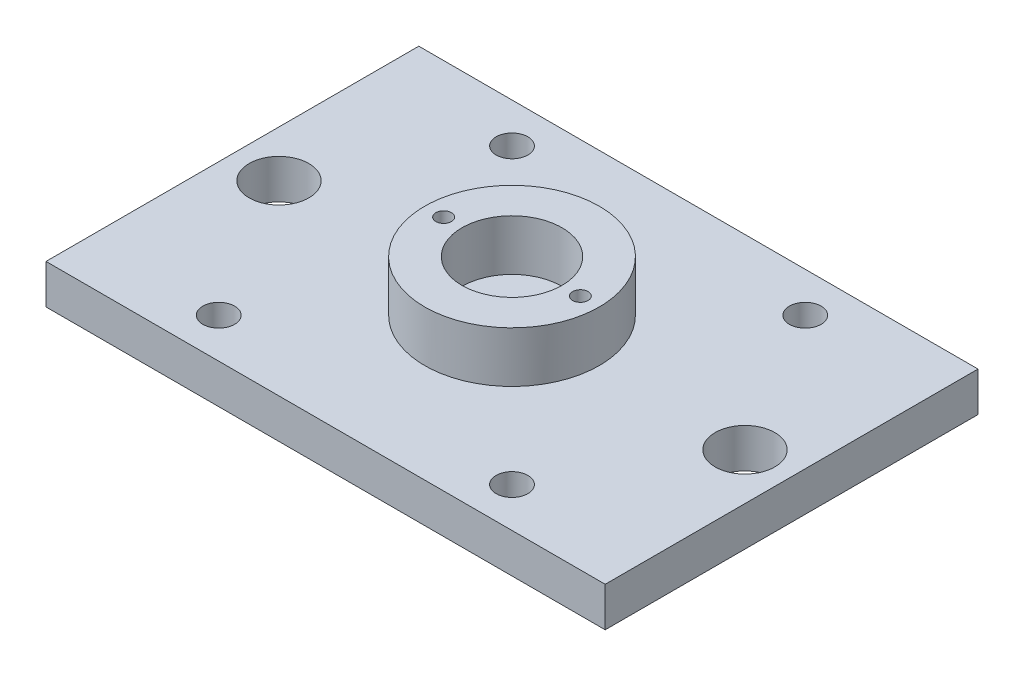
ISO-10303-21;
HEADER;
FILE_DESCRIPTION(('STEP AP214'),'2;1');
FILE_NAME('part.step','',(''),(''),'','','');
FILE_SCHEMA(('AUTOMOTIVE_DESIGN { 1 0 10303 214 1 1 1 1 }'));
ENDSEC;
DATA;
#1=APPLICATION_CONTEXT('core data for automotive mechanical design processes');
#2=APPLICATION_PROTOCOL_DEFINITION('international standard','automotive_design',2000,#1);
#3=PRODUCT_CONTEXT('',#1,'mechanical');
#4=PRODUCT('Part','Part','',(#3));
#5=PRODUCT_RELATED_PRODUCT_CATEGORY('part','',(#4));
#6=PRODUCT_DEFINITION_FORMATION('','',#4);
#7=PRODUCT_DEFINITION_CONTEXT('part definition',#1,'design');
#8=PRODUCT_DEFINITION('design','',#6,#7);
#9=PRODUCT_DEFINITION_SHAPE('','',#8);
#10=(LENGTH_UNIT() NAMED_UNIT(*) SI_UNIT(.MILLI.,.METRE.));
#11=(NAMED_UNIT(*) PLANE_ANGLE_UNIT() SI_UNIT($,.RADIAN.));
#12=(NAMED_UNIT(*) SI_UNIT($,.STERADIAN.) SOLID_ANGLE_UNIT());
#13=UNCERTAINTY_MEASURE_WITH_UNIT(LENGTH_MEASURE(1.E-05),#10,'distance_accuracy_value','');
#14=(GEOMETRIC_REPRESENTATION_CONTEXT(3) GLOBAL_UNCERTAINTY_ASSIGNED_CONTEXT((#13)) GLOBAL_UNIT_ASSIGNED_CONTEXT((#10,
#11,#12)) REPRESENTATION_CONTEXT('',''));
#15=CARTESIAN_POINT('',(0.,0.,0.));
#16=DIRECTION('',(0.,0.,1.));
#17=DIRECTION('',(1.,0.,0.));
#18=AXIS2_PLACEMENT_3D('',#15,#16,#17);
#19=CARTESIAN_POINT('',(0.,6.35,0.));
#20=DIRECTION('',(0.,-1.,0.));
#21=DIRECTION('',(0.,0.,-1.));
#22=AXIS2_PLACEMENT_3D('',#19,#20,#21);
#23=PLANE('',#22);
#24=CARTESIAN_POINT('',(0.,6.35,0.));
#25=DIRECTION('',(0.,-1.,0.));
#26=DIRECTION('',(0.,0.,-1.));
#27=AXIS2_PLACEMENT_3D('',#24,#25,#26);
#28=CIRCLE('',#27,14.05);
#29=CARTESIAN_POINT('',(0.,6.35,-14.05));
#30=VERTEX_POINT('',#29);
#31=EDGE_CURVE('E11',#30,#30,#28,.F.);
#32=ORIENTED_EDGE('',*,*,#31,.F.);
#33=EDGE_LOOP('',(#32));
#34=FACE_BOUND('',#33,.T.);
#35=DIRECTION('',(0.,0.,1.));
#36=VECTOR('',#35,1.);
#37=CARTESIAN_POINT('',(-45.,6.35,-30.));
#38=LINE('',#37,#36);
#39=CARTESIAN_POINT('',(-45.,6.35,-30.));
#40=VERTEX_POINT('',#39);
#41=CARTESIAN_POINT('',(-45.,6.35,30.));
#42=VERTEX_POINT('',#41);
#43=EDGE_CURVE('E94',#40,#42,#38,.T.);
#44=ORIENTED_EDGE('',*,*,#43,.T.);
#45=DIRECTION('',(1.,0.,0.));
#46=VECTOR('',#45,1.);
#47=CARTESIAN_POINT('',(45.,6.35,30.));
#48=LINE('',#47,#46);
#49=CARTESIAN_POINT('',(45.,6.35,30.));
#50=VERTEX_POINT('',#49);
#51=EDGE_CURVE('E89',#42,#50,#48,.T.);
#52=ORIENTED_EDGE('',*,*,#51,.T.);
#53=DIRECTION('',(0.,0.,-1.));
#54=VECTOR('',#53,1.);
#55=CARTESIAN_POINT('',(45.,6.35,-30.));
#56=LINE('',#55,#54);
#57=CARTESIAN_POINT('',(45.,6.35,-30.));
#58=VERTEX_POINT('',#57);
#59=EDGE_CURVE('E92',#50,#58,#56,.T.);
#60=ORIENTED_EDGE('',*,*,#59,.T.);
#61=DIRECTION('',(-1.,0.,0.));
#62=VECTOR('',#61,1.);
#63=CARTESIAN_POINT('',(45.,6.35,-30.));
#64=LINE('',#63,#62);
#65=EDGE_CURVE('E58',#58,#40,#64,.T.);
#66=ORIENTED_EDGE('',*,*,#65,.T.);
#67=EDGE_LOOP('',(#44,#52,#60,#66));
#68=FACE_BOUND('',#67,.T.);
#69=CARTESIAN_POINT('',(-37.5,6.35,0.));
#70=DIRECTION('',(0.,1.,0.));
#71=DIRECTION('',(0.,0.,1.));
#72=AXIS2_PLACEMENT_3D('',#69,#70,#71);
#73=CIRCLE('',#72,4.8);
#74=CARTESIAN_POINT('',(-37.5,6.35,4.8));
#75=VERTEX_POINT('',#74);
#76=EDGE_CURVE('E111',#75,#75,#73,.T.);
#77=ORIENTED_EDGE('',*,*,#76,.F.);
#78=EDGE_LOOP('',(#77));
#79=FACE_BOUND('',#78,.T.);
#80=CARTESIAN_POINT('',(37.5,6.35,0.));
#81=DIRECTION('',(0.,1.,0.));
#82=DIRECTION('',(0.,0.,1.));
#83=AXIS2_PLACEMENT_3D('',#80,#81,#82);
#84=CIRCLE('',#83,4.8);
#85=CARTESIAN_POINT('',(37.5,6.35,4.8));
#86=VERTEX_POINT('',#85);
#87=EDGE_CURVE('E161',#86,#86,#84,.T.);
#88=ORIENTED_EDGE('',*,*,#87,.F.);
#89=EDGE_LOOP('',(#88));
#90=FACE_BOUND('',#89,.T.);
#91=CARTESIAN_POINT('',(-23.6,6.35,23.6));
#92=DIRECTION('',(0.,1.,0.));
#93=DIRECTION('',(0.,0.,1.));
#94=AXIS2_PLACEMENT_3D('',#91,#92,#93);
#95=CIRCLE('',#94,2.55);
#96=CARTESIAN_POINT('',(-23.6,6.35,26.15));
#97=VERTEX_POINT('',#96);
#98=EDGE_CURVE('E156',#97,#97,#95,.T.);
#99=ORIENTED_EDGE('',*,*,#98,.F.);
#100=EDGE_LOOP('',(#99));
#101=FACE_BOUND('',#100,.T.);
#102=CARTESIAN_POINT('',(23.6,6.35,23.6));
#103=DIRECTION('',(0.,1.,0.));
#104=DIRECTION('',(0.,0.,1.));
#105=AXIS2_PLACEMENT_3D('',#102,#103,#104);
#106=CIRCLE('',#105,2.55);
#107=CARTESIAN_POINT('',(23.6,6.35,26.15));
#108=VERTEX_POINT('',#107);
#109=EDGE_CURVE('E151',#108,#108,#106,.T.);
#110=ORIENTED_EDGE('',*,*,#109,.F.);
#111=EDGE_LOOP('',(#110));
#112=FACE_BOUND('',#111,.T.);
#113=CARTESIAN_POINT('',(23.6,6.35,-23.6));
#114=DIRECTION('',(0.,1.,0.));
#115=DIRECTION('',(0.,0.,1.));
#116=AXIS2_PLACEMENT_3D('',#113,#114,#115);
#117=CIRCLE('',#116,2.55);
#118=CARTESIAN_POINT('',(23.6,6.35,-21.05));
#119=VERTEX_POINT('',#118);
#120=EDGE_CURVE('E146',#119,#119,#117,.T.);
#121=ORIENTED_EDGE('',*,*,#120,.F.);
#122=EDGE_LOOP('',(#121));
#123=FACE_BOUND('',#122,.T.);
#124=CARTESIAN_POINT('',(-23.6,6.35,-23.6));
#125=DIRECTION('',(0.,1.,0.));
#126=DIRECTION('',(0.,0.,1.));
#127=AXIS2_PLACEMENT_3D('',#124,#125,#126);
#128=CIRCLE('',#127,2.55);
#129=CARTESIAN_POINT('',(-23.6,6.35,-21.05));
#130=VERTEX_POINT('',#129);
#131=EDGE_CURVE('E136',#130,#130,#128,.T.);
#132=ORIENTED_EDGE('',*,*,#131,.F.);
#133=EDGE_LOOP('',(#132));
#134=FACE_BOUND('',#133,.T.);
#135=ADVANCED_FACE('F41',(#34,#68,#79,#90,#101,#112,#123,#134),#23,.F.);
#136=CARTESIAN_POINT('',(0.,0.,0.));
#137=DIRECTION('',(0.,-1.,0.));
#138=DIRECTION('',(0.,0.,-1.));
#139=AXIS2_PLACEMENT_3D('',#136,#137,#138);
#140=PLANE('',#139);
#141=CARTESIAN_POINT('',(23.6,0.,-23.6));
#142=DIRECTION('',(0.,1.,0.));
#143=DIRECTION('',(0.,0.,1.));
#144=AXIS2_PLACEMENT_3D('',#141,#142,#143);
#145=CIRCLE('',#144,2.55);
#146=CARTESIAN_POINT('',(23.6,0.,-21.05));
#147=VERTEX_POINT('',#146);
#148=EDGE_CURVE('E140',#147,#147,#145,.T.);
#149=ORIENTED_EDGE('',*,*,#148,.T.);
#150=EDGE_LOOP('',(#149));
#151=FACE_BOUND('',#150,.T.);
#152=CARTESIAN_POINT('',(-23.6,0.,23.6));
#153=DIRECTION('',(0.,1.,0.));
#154=DIRECTION('',(0.,0.,1.));
#155=AXIS2_PLACEMENT_3D('',#152,#153,#154);
#156=CIRCLE('',#155,2.55);
#157=CARTESIAN_POINT('',(-23.6,0.,26.15));
#158=VERTEX_POINT('',#157);
#159=EDGE_CURVE('E154',#158,#158,#156,.T.);
#160=ORIENTED_EDGE('',*,*,#159,.T.);
#161=EDGE_LOOP('',(#160));
#162=FACE_BOUND('',#161,.T.);
#163=CARTESIAN_POINT('',(-37.5,0.,0.));
#164=DIRECTION('',(0.,1.,0.));
#165=DIRECTION('',(0.,0.,1.));
#166=AXIS2_PLACEMENT_3D('',#163,#164,#165);
#167=CIRCLE('',#166,4.8);
#168=CARTESIAN_POINT('',(-37.5,0.,4.8));
#169=VERTEX_POINT('',#168);
#170=EDGE_CURVE('E164',#169,#169,#167,.T.);
#171=ORIENTED_EDGE('',*,*,#170,.T.);
#172=EDGE_LOOP('',(#171));
#173=FACE_BOUND('',#172,.T.);
#174=DIRECTION('',(0.,0.,1.));
#175=VECTOR('',#174,1.);
#176=CARTESIAN_POINT('',(-45.,0.,-30.));
#177=LINE('',#176,#175);
#178=CARTESIAN_POINT('',(-45.,0.,-30.));
#179=VERTEX_POINT('',#178);
#180=CARTESIAN_POINT('',(-45.,0.,30.));
#181=VERTEX_POINT('',#180);
#182=EDGE_CURVE('E108',#179,#181,#177,.T.);
#183=ORIENTED_EDGE('',*,*,#182,.F.);
#184=DIRECTION('',(-1.,0.,0.));
#185=VECTOR('',#184,1.);
#186=CARTESIAN_POINT('',(45.,0.,-30.));
#187=LINE('',#186,#185);
#188=CARTESIAN_POINT('',(45.,0.,-30.));
#189=VERTEX_POINT('',#188);
#190=EDGE_CURVE('E81',#189,#179,#187,.T.);
#191=ORIENTED_EDGE('',*,*,#190,.F.);
#192=DIRECTION('',(0.,0.,-1.));
#193=VECTOR('',#192,1.);
#194=CARTESIAN_POINT('',(45.,0.,-30.));
#195=LINE('',#194,#193);
#196=CARTESIAN_POINT('',(45.,0.,30.));
#197=VERTEX_POINT('',#196);
#198=EDGE_CURVE('E75',#197,#189,#195,.T.);
#199=ORIENTED_EDGE('',*,*,#198,.F.);
#200=DIRECTION('',(1.,0.,0.));
#201=VECTOR('',#200,1.);
#202=CARTESIAN_POINT('',(45.,0.,30.));
#203=LINE('',#202,#201);
#204=EDGE_CURVE('E99',#181,#197,#203,.T.);
#205=ORIENTED_EDGE('',*,*,#204,.F.);
#206=EDGE_LOOP('',(#183,#191,#199,#205));
#207=FACE_BOUND('',#206,.T.);
#208=CARTESIAN_POINT('',(37.5,0.,0.));
#209=DIRECTION('',(0.,1.,0.));
#210=DIRECTION('',(0.,0.,1.));
#211=AXIS2_PLACEMENT_3D('',#208,#209,#210);
#212=CIRCLE('',#211,4.8);
#213=CARTESIAN_POINT('',(37.5,0.,4.8));
#214=VERTEX_POINT('',#213);
#215=EDGE_CURVE('E127',#214,#214,#212,.T.);
#216=ORIENTED_EDGE('',*,*,#215,.T.);
#217=EDGE_LOOP('',(#216));
#218=FACE_BOUND('',#217,.T.);
#219=CARTESIAN_POINT('',(23.6,0.,23.6));
#220=DIRECTION('',(0.,1.,0.));
#221=DIRECTION('',(0.,0.,1.));
#222=AXIS2_PLACEMENT_3D('',#219,#220,#221);
#223=CIRCLE('',#222,2.55);
#224=CARTESIAN_POINT('',(23.6,0.,26.15));
#225=VERTEX_POINT('',#224);
#226=EDGE_CURVE('E131',#225,#225,#223,.T.);
#227=ORIENTED_EDGE('',*,*,#226,.T.);
#228=EDGE_LOOP('',(#227));
#229=FACE_BOUND('',#228,.T.);
#230=CARTESIAN_POINT('',(-23.6,0.,-23.6));
#231=DIRECTION('',(0.,1.,0.));
#232=DIRECTION('',(0.,0.,1.));
#233=AXIS2_PLACEMENT_3D('',#230,#231,#232);
#234=CIRCLE('',#233,2.55);
#235=CARTESIAN_POINT('',(-23.6,0.,-21.05));
#236=VERTEX_POINT('',#235);
#237=EDGE_CURVE('E134',#236,#236,#234,.T.);
#238=ORIENTED_EDGE('',*,*,#237,.T.);
#239=EDGE_LOOP('',(#238));
#240=FACE_BOUND('',#239,.T.);
#241=ADVANCED_FACE('F119',(#151,#162,#173,#207,#218,#229,#240),#140,.T.);
#242=CARTESIAN_POINT('',(-45.,6.35,-30.));
#243=DIRECTION('',(1.,0.,0.));
#244=DIRECTION('',(0.,0.,-1.));
#245=AXIS2_PLACEMENT_3D('',#242,#243,#244);
#246=PLANE('',#245);
#247=ORIENTED_EDGE('',*,*,#182,.T.);
#248=DIRECTION('',(0.,-1.,0.));
#249=VECTOR('',#248,1.);
#250=CARTESIAN_POINT('',(-45.,6.35,30.));
#251=LINE('',#250,#249);
#252=EDGE_CURVE('E50',#42,#181,#251,.T.);
#253=ORIENTED_EDGE('',*,*,#252,.F.);
#254=ORIENTED_EDGE('',*,*,#43,.F.);
#255=DIRECTION('',(0.,-1.,0.));
#256=VECTOR('',#255,1.);
#257=CARTESIAN_POINT('',(-45.,6.35,-30.));
#258=LINE('',#257,#256);
#259=EDGE_CURVE('E104',#40,#179,#258,.T.);
#260=ORIENTED_EDGE('',*,*,#259,.T.);
#261=EDGE_LOOP('',(#247,#253,#254,#260));
#262=FACE_BOUND('',#261,.T.);
#263=ADVANCED_FACE('F43',(#262),#246,.F.);
#264=CARTESIAN_POINT('',(45.,6.35,30.));
#265=DIRECTION('',(0.,0.,-1.));
#266=DIRECTION('',(-1.,0.,0.));
#267=AXIS2_PLACEMENT_3D('',#264,#265,#266);
#268=PLANE('',#267);
#269=ORIENTED_EDGE('',*,*,#204,.T.);
#270=DIRECTION('',(0.,-1.,0.));
#271=VECTOR('',#270,1.);
#272=CARTESIAN_POINT('',(45.,6.35,30.));
#273=LINE('',#272,#271);
#274=EDGE_CURVE('E97',#50,#197,#273,.T.);
#275=ORIENTED_EDGE('',*,*,#274,.F.);
#276=ORIENTED_EDGE('',*,*,#51,.F.);
#277=ORIENTED_EDGE('',*,*,#252,.T.);
#278=EDGE_LOOP('',(#269,#275,#276,#277));
#279=FACE_BOUND('',#278,.T.);
#280=ADVANCED_FACE('F98',(#279),#268,.F.);
#281=CARTESIAN_POINT('',(45.,6.35,-30.));
#282=DIRECTION('',(-1.,0.,0.));
#283=DIRECTION('',(0.,0.,1.));
#284=AXIS2_PLACEMENT_3D('',#281,#282,#283);
#285=PLANE('',#284);
#286=ORIENTED_EDGE('',*,*,#198,.T.);
#287=DIRECTION('',(0.,-1.,0.));
#288=VECTOR('',#287,1.);
#289=CARTESIAN_POINT('',(45.,6.35,-30.));
#290=LINE('',#289,#288);
#291=EDGE_CURVE('E100',#58,#189,#290,.T.);
#292=ORIENTED_EDGE('',*,*,#291,.F.);
#293=ORIENTED_EDGE('',*,*,#59,.F.);
#294=ORIENTED_EDGE('',*,*,#274,.T.);
#295=EDGE_LOOP('',(#286,#292,#293,#294));
#296=FACE_BOUND('',#295,.T.);
#297=ADVANCED_FACE('F102',(#296),#285,.F.);
#298=CARTESIAN_POINT('',(45.,6.35,-30.));
#299=DIRECTION('',(0.,0.,1.));
#300=DIRECTION('',(1.,0.,0.));
#301=AXIS2_PLACEMENT_3D('',#298,#299,#300);
#302=PLANE('',#301);
#303=ORIENTED_EDGE('',*,*,#190,.T.);
#304=ORIENTED_EDGE('',*,*,#259,.F.);
#305=ORIENTED_EDGE('',*,*,#65,.F.);
#306=ORIENTED_EDGE('',*,*,#291,.T.);
#307=EDGE_LOOP('',(#303,#304,#305,#306));
#308=FACE_BOUND('',#307,.T.);
#309=ADVANCED_FACE('F175',(#308),#302,.F.);
#310=CARTESIAN_POINT('',(-37.5,6.35,0.));
#311=DIRECTION('',(0.,-1.,0.));
#312=DIRECTION('',(0.,0.,-1.));
#313=AXIS2_PLACEMENT_3D('',#310,#311,#312);
#314=CYLINDRICAL_SURFACE('',#313,4.8);
#315=ORIENTED_EDGE('',*,*,#76,.T.);
#316=EDGE_LOOP('',(#315));
#317=FACE_BOUND('',#316,.T.);
#318=ORIENTED_EDGE('',*,*,#170,.F.);
#319=EDGE_LOOP('',(#318));
#320=FACE_BOUND('',#319,.T.);
#321=ADVANCED_FACE('F172',(#317,#320),#314,.F.);
#322=CARTESIAN_POINT('',(37.5,6.35,0.));
#323=DIRECTION('',(0.,-1.,0.));
#324=DIRECTION('',(0.,0.,-1.));
#325=AXIS2_PLACEMENT_3D('',#322,#323,#324);
#326=CYLINDRICAL_SURFACE('',#325,4.8);
#327=ORIENTED_EDGE('',*,*,#87,.T.);
#328=EDGE_LOOP('',(#327));
#329=FACE_BOUND('',#328,.T.);
#330=ORIENTED_EDGE('',*,*,#215,.F.);
#331=EDGE_LOOP('',(#330));
#332=FACE_BOUND('',#331,.T.);
#333=ADVANCED_FACE('F174',(#329,#332),#326,.F.);
#334=CARTESIAN_POINT('',(-23.6,6.35,23.6));
#335=DIRECTION('',(0.,-1.,0.));
#336=DIRECTION('',(0.,0.,-1.));
#337=AXIS2_PLACEMENT_3D('',#334,#335,#336);
#338=CYLINDRICAL_SURFACE('',#337,2.55);
#339=ORIENTED_EDGE('',*,*,#98,.T.);
#340=EDGE_LOOP('',(#339));
#341=FACE_BOUND('',#340,.T.);
#342=ORIENTED_EDGE('',*,*,#159,.F.);
#343=EDGE_LOOP('',(#342));
#344=FACE_BOUND('',#343,.T.);
#345=ADVANCED_FACE('F182',(#341,#344),#338,.F.);
#346=CARTESIAN_POINT('',(23.6,6.35,23.6));
#347=DIRECTION('',(0.,-1.,0.));
#348=DIRECTION('',(0.,0.,-1.));
#349=AXIS2_PLACEMENT_3D('',#346,#347,#348);
#350=CYLINDRICAL_SURFACE('',#349,2.55);
#351=ORIENTED_EDGE('',*,*,#109,.T.);
#352=EDGE_LOOP('',(#351));
#353=FACE_BOUND('',#352,.T.);
#354=ORIENTED_EDGE('',*,*,#226,.F.);
#355=EDGE_LOOP('',(#354));
#356=FACE_BOUND('',#355,.T.);
#357=ADVANCED_FACE('F253',(#353,#356),#350,.F.);
#358=CARTESIAN_POINT('',(23.6,6.35,-23.6));
#359=DIRECTION('',(0.,-1.,0.));
#360=DIRECTION('',(0.,0.,-1.));
#361=AXIS2_PLACEMENT_3D('',#358,#359,#360);
#362=CYLINDRICAL_SURFACE('',#361,2.55);
#363=ORIENTED_EDGE('',*,*,#120,.T.);
#364=EDGE_LOOP('',(#363));
#365=FACE_BOUND('',#364,.T.);
#366=ORIENTED_EDGE('',*,*,#148,.F.);
#367=EDGE_LOOP('',(#366));
#368=FACE_BOUND('',#367,.T.);
#369=ADVANCED_FACE('F249',(#365,#368),#362,.F.);
#370=CARTESIAN_POINT('',(-23.6,6.35,-23.6));
#371=DIRECTION('',(0.,-1.,0.));
#372=DIRECTION('',(0.,0.,-1.));
#373=AXIS2_PLACEMENT_3D('',#370,#371,#372);
#374=CYLINDRICAL_SURFACE('',#373,2.55);
#375=ORIENTED_EDGE('',*,*,#131,.T.);
#376=EDGE_LOOP('',(#375));
#377=FACE_BOUND('',#376,.T.);
#378=ORIENTED_EDGE('',*,*,#237,.F.);
#379=EDGE_LOOP('',(#378));
#380=FACE_BOUND('',#379,.T.);
#381=ADVANCED_FACE('F235',(#377,#380),#374,.F.);
#382=CARTESIAN_POINT('',(0.,14.525,0.));
#383=DIRECTION('',(0.,1.,0.));
#384=DIRECTION('',(0.,0.,1.));
#385=AXIS2_PLACEMENT_3D('',#382,#383,#384);
#386=PLANE('',#385);
#387=CARTESIAN_POINT('',(-11.,14.525,0.));
#388=DIRECTION('',(0.,1.,0.));
#389=DIRECTION('',(0.,0.,1.));
#390=AXIS2_PLACEMENT_3D('',#387,#388,#389);
#391=CIRCLE('',#390,1.25);
#392=CARTESIAN_POINT('',(-11.,14.525,1.25));
#393=VERTEX_POINT('',#392);
#394=EDGE_CURVE('E219',#393,#393,#391,.T.);
#395=ORIENTED_EDGE('',*,*,#394,.F.);
#396=EDGE_LOOP('',(#395));
#397=FACE_BOUND('',#396,.T.);
#398=CARTESIAN_POINT('',(11.,14.525,0.));
#399=DIRECTION('',(0.,1.,0.));
#400=DIRECTION('',(0.,0.,1.));
#401=AXIS2_PLACEMENT_3D('',#398,#399,#400);
#402=CIRCLE('',#401,1.25);
#403=CARTESIAN_POINT('',(11.,14.525,1.25));
#404=VERTEX_POINT('',#403);
#405=EDGE_CURVE('E225',#404,#404,#402,.T.);
#406=ORIENTED_EDGE('',*,*,#405,.F.);
#407=EDGE_LOOP('',(#406));
#408=FACE_BOUND('',#407,.T.);
#409=CARTESIAN_POINT('',(0.,14.525,0.));
#410=DIRECTION('',(0.,1.,0.));
#411=DIRECTION('',(0.,0.,1.));
#412=AXIS2_PLACEMENT_3D('',#409,#410,#411);
#413=CIRCLE('',#412,14.05);
#414=CARTESIAN_POINT('',(0.,14.525,14.05));
#415=VERTEX_POINT('',#414);
#416=EDGE_CURVE('E137',#415,#415,#413,.T.);
#417=ORIENTED_EDGE('',*,*,#416,.T.);
#418=EDGE_LOOP('',(#417));
#419=FACE_BOUND('',#418,.T.);
#420=CARTESIAN_POINT('',(0.,14.525,0.));
#421=DIRECTION('',(0.,1.,0.));
#422=DIRECTION('',(0.,0.,1.));
#423=AXIS2_PLACEMENT_3D('',#420,#421,#422);
#424=CIRCLE('',#423,8.05);
#425=CARTESIAN_POINT('',(0.,14.525,8.05));
#426=VERTEX_POINT('',#425);
#427=EDGE_CURVE('E143',#426,#426,#424,.T.);
#428=ORIENTED_EDGE('',*,*,#427,.F.);
#429=EDGE_LOOP('',(#428));
#430=FACE_BOUND('',#429,.T.);
#431=ADVANCED_FACE('F233',(#397,#408,#419,#430),#386,.T.);
#432=CARTESIAN_POINT('',(0.,14.525,0.));
#433=DIRECTION('',(0.,-1.,0.));
#434=DIRECTION('',(0.,0.,-1.));
#435=AXIS2_PLACEMENT_3D('',#432,#433,#434);
#436=CYLINDRICAL_SURFACE('',#435,14.05);
#437=ORIENTED_EDGE('',*,*,#416,.F.);
#438=EDGE_LOOP('',(#437));
#439=FACE_BOUND('',#438,.T.);
#440=ORIENTED_EDGE('',*,*,#31,.T.);
#441=EDGE_LOOP('',(#440));
#442=FACE_BOUND('',#441,.T.);
#443=ADVANCED_FACE('F207',(#439,#442),#436,.T.);
#444=CARTESIAN_POINT('',(0.,14.525,0.));
#445=DIRECTION('',(0.,-1.,0.));
#446=DIRECTION('',(0.,0.,-1.));
#447=AXIS2_PLACEMENT_3D('',#444,#445,#446);
#448=CYLINDRICAL_SURFACE('',#447,8.05);
#449=ORIENTED_EDGE('',*,*,#427,.T.);
#450=EDGE_LOOP('',(#449));
#451=FACE_BOUND('',#450,.T.);
#452=CARTESIAN_POINT('',(0.,6.35,0.));
#453=DIRECTION('',(0.,1.,0.));
#454=DIRECTION('',(0.,0.,1.));
#455=AXIS2_PLACEMENT_3D('',#452,#453,#454);
#456=CIRCLE('',#455,8.05);
#457=CARTESIAN_POINT('',(0.,6.35,8.05));
#458=VERTEX_POINT('',#457);
#459=EDGE_CURVE('E212',#458,#458,#456,.T.);
#460=ORIENTED_EDGE('',*,*,#459,.F.);
#461=EDGE_LOOP('',(#460));
#462=FACE_BOUND('',#461,.T.);
#463=ADVANCED_FACE('F197',(#451,#462),#448,.F.);
#464=ORIENTED_EDGE('',*,*,#459,.T.);
#465=EDGE_LOOP('',(#464));
#466=FACE_BOUND('',#465,.T.);
#467=ADVANCED_FACE('F189',(#466),#23,.F.);
#468=CARTESIAN_POINT('',(11.,6.525,0.));
#469=DIRECTION('',(0.,1.,0.));
#470=DIRECTION('',(0.,0.,1.));
#471=AXIS2_PLACEMENT_3D('',#468,#469,#470);
#472=CYLINDRICAL_SURFACE('',#471,1.25);
#473=CARTESIAN_POINT('',(11.,6.525,0.));
#474=DIRECTION('',(0.,1.,0.));
#475=DIRECTION('',(0.,0.,1.));
#476=AXIS2_PLACEMENT_3D('',#473,#474,#475);
#477=CIRCLE('',#476,1.25);
#478=CARTESIAN_POINT('',(11.,6.525,1.25));
#479=VERTEX_POINT('',#478);
#480=EDGE_CURVE('E222',#479,#479,#477,.T.);
#481=ORIENTED_EDGE('',*,*,#480,.F.);
#482=EDGE_LOOP('',(#481));
#483=FACE_BOUND('',#482,.T.);
#484=ORIENTED_EDGE('',*,*,#405,.T.);
#485=EDGE_LOOP('',(#484));
#486=FACE_BOUND('',#485,.T.);
#487=ADVANCED_FACE('F196',(#483,#486),#472,.F.);
#488=CARTESIAN_POINT('',(11.,6.525,0.));
#489=DIRECTION('',(0.,1.,0.));
#490=DIRECTION('',(0.,0.,1.));
#491=AXIS2_PLACEMENT_3D('',#488,#489,#490);
#492=PLANE('',#491);
#493=ORIENTED_EDGE('',*,*,#480,.T.);
#494=EDGE_LOOP('',(#493));
#495=FACE_BOUND('',#494,.T.);
#496=ADVANCED_FACE('F204',(#495),#492,.T.);
#497=CARTESIAN_POINT('',(-11.,6.525,0.));
#498=DIRECTION('',(0.,1.,0.));
#499=DIRECTION('',(0.,0.,1.));
#500=AXIS2_PLACEMENT_3D('',#497,#498,#499);
#501=CYLINDRICAL_SURFACE('',#500,1.25);
#502=CARTESIAN_POINT('',(-11.,6.525,0.));
#503=DIRECTION('',(0.,1.,0.));
#504=DIRECTION('',(0.,0.,1.));
#505=AXIS2_PLACEMENT_3D('',#502,#503,#504);
#506=CIRCLE('',#505,1.25);
#507=CARTESIAN_POINT('',(-11.,6.525,1.25));
#508=VERTEX_POINT('',#507);
#509=EDGE_CURVE('E214',#508,#508,#506,.T.);
#510=ORIENTED_EDGE('',*,*,#509,.F.);
#511=EDGE_LOOP('',(#510));
#512=FACE_BOUND('',#511,.T.);
#513=ORIENTED_EDGE('',*,*,#394,.T.);
#514=EDGE_LOOP('',(#513));
#515=FACE_BOUND('',#514,.T.);
#516=ADVANCED_FACE('F231',(#512,#515),#501,.F.);
#517=CARTESIAN_POINT('',(-11.,6.525,0.));
#518=DIRECTION('',(0.,1.,0.));
#519=DIRECTION('',(0.,0.,1.));
#520=AXIS2_PLACEMENT_3D('',#517,#518,#519);
#521=PLANE('',#520);
#522=ORIENTED_EDGE('',*,*,#509,.T.);
#523=EDGE_LOOP('',(#522));
#524=FACE_BOUND('',#523,.T.);
#525=ADVANCED_FACE('F338',(#524),#521,.T.);
#526=CLOSED_SHELL('',(#135,#241,#263,#280,#297,#309,#321,#333,#345,#357,#369,#381,#431,#443,
#463,#467,#487,#496,#516,#525));
#527=MANIFOLD_SOLID_BREP('B2',#526);
#528=ADVANCED_BREP_SHAPE_REPRESENTATION('',(#18,#527),#14);
#529=SHAPE_DEFINITION_REPRESENTATION(#9,#528);
ENDSEC;
END-ISO-10303-21;
